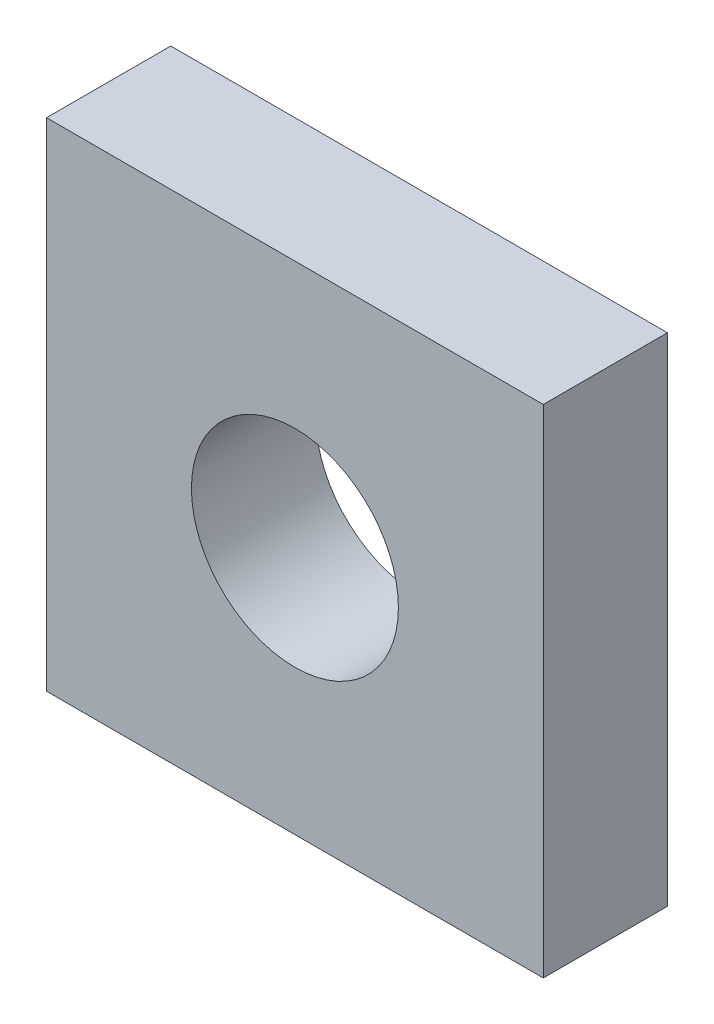
ISO-10303-21;
HEADER;
FILE_DESCRIPTION(('STEP AP214'),'2;1');
FILE_NAME('part.step','',(''),(''),'','','');
FILE_SCHEMA(('AUTOMOTIVE_DESIGN { 1 0 10303 214 1 1 1 1 }'));
ENDSEC;
DATA;
#1=APPLICATION_CONTEXT('core data for automotive mechanical design processes');
#2=APPLICATION_PROTOCOL_DEFINITION('international standard','automotive_design',2000,#1);
#3=PRODUCT_CONTEXT('',#1,'mechanical');
#4=PRODUCT('Part','Part','',(#3));
#5=PRODUCT_RELATED_PRODUCT_CATEGORY('part','',(#4));
#6=PRODUCT_DEFINITION_FORMATION('','',#4);
#7=PRODUCT_DEFINITION_CONTEXT('part definition',#1,'design');
#8=PRODUCT_DEFINITION('design','',#6,#7);
#9=PRODUCT_DEFINITION_SHAPE('','',#8);
#10=(LENGTH_UNIT() NAMED_UNIT(*) SI_UNIT(.MILLI.,.METRE.));
#11=(NAMED_UNIT(*) PLANE_ANGLE_UNIT() SI_UNIT($,.RADIAN.));
#12=(NAMED_UNIT(*) SI_UNIT($,.STERADIAN.) SOLID_ANGLE_UNIT());
#13=UNCERTAINTY_MEASURE_WITH_UNIT(LENGTH_MEASURE(1.E-05),#10,'distance_accuracy_value','');
#14=(GEOMETRIC_REPRESENTATION_CONTEXT(3) GLOBAL_UNCERTAINTY_ASSIGNED_CONTEXT((#13)) GLOBAL_UNIT_ASSIGNED_CONTEXT((#10,
#11,#12)) REPRESENTATION_CONTEXT('',''));
#15=CARTESIAN_POINT('',(0.,0.,0.));
#16=DIRECTION('',(0.,0.,1.));
#17=DIRECTION('',(1.,0.,0.));
#18=AXIS2_PLACEMENT_3D('',#15,#16,#17);
#19=CARTESIAN_POINT('',(30.,-30.0000000000007,7.50000000000006));
#20=DIRECTION('',(0.,0.999999999999999,0.));
#21=DIRECTION('',(0.,0.,0.999999999999999));
#22=AXIS2_PLACEMENT_3D('',#19,#20,#21);
#23=PLANE('',#22);
#24=DIRECTION('',(0.,0.,-0.999999999999999));
#25=VECTOR('',#24,1.);
#26=CARTESIAN_POINT('',(-29.9999999999998,-30.0000000000006,7.49999999999995));
#27=LINE('',#26,#25);
#28=CARTESIAN_POINT('',(-29.9999999999998,-30.0000000000006,7.49999999999995));
#29=VERTEX_POINT('',#28);
#30=CARTESIAN_POINT('',(-29.9999999999999,-30.0000000000009,-7.50000000000006));
#31=VERTEX_POINT('',#30);
#32=EDGE_CURVE('E113',#29,#31,#27,.T.);
#33=ORIENTED_EDGE('',*,*,#32,.T.);
#34=DIRECTION('',(-0.999999999999998,0.,0.));
#35=VECTOR('',#34,1.);
#36=CARTESIAN_POINT('',(29.9999999999999,-30.0000000000008,-7.49999999999995));
#37=LINE('',#36,#35);
#38=CARTESIAN_POINT('',(29.9999999999999,-30.0000000000008,-7.49999999999995));
#39=VERTEX_POINT('',#38);
#40=EDGE_CURVE('E12',#39,#31,#37,.T.);
#41=ORIENTED_EDGE('',*,*,#40,.F.);
#42=DIRECTION('',(0.,0.,-0.999999999999999));
#43=VECTOR('',#42,1.);
#44=CARTESIAN_POINT('',(30.,-30.0000000000007,7.50000000000006));
#45=LINE('',#44,#43);
#46=CARTESIAN_POINT('',(30.,-30.0000000000007,7.50000000000006));
#47=VERTEX_POINT('',#46);
#48=EDGE_CURVE('E101',#47,#39,#45,.T.);
#49=ORIENTED_EDGE('',*,*,#48,.F.);
#50=DIRECTION('',(-0.999999999999998,0.,0.));
#51=VECTOR('',#50,1.);
#52=CARTESIAN_POINT('',(30.,-30.0000000000007,7.50000000000006));
#53=LINE('',#52,#51);
#54=EDGE_CURVE('E109',#47,#29,#53,.T.);
#55=ORIENTED_EDGE('',*,*,#54,.T.);
#56=EDGE_LOOP('',(#33,#41,#49,#55));
#57=FACE_BOUND('',#56,.T.);
#58=ADVANCED_FACE('F50',(#57),#23,.F.);
#59=CARTESIAN_POINT('',(29.9999999999999,-30.0000000000008,-7.49999999999995));
#60=DIRECTION('',(0.,0.,0.999999999999999));
#61=DIRECTION('',(0.999999999999998,0.,0.));
#62=AXIS2_PLACEMENT_3D('',#59,#60,#61);
#63=PLANE('',#62);
#64=CARTESIAN_POINT('',(2.22044604925031E-13,-6.66133814775094E-13,-7.49999999999995));
#65=DIRECTION('',(0.,0.,0.999999999999999));
#66=DIRECTION('',(0.999999999999998,0.,0.));
#67=AXIS2_PLACEMENT_3D('',#64,#65,#66);
#68=CIRCLE('',#67,12.5);
#69=CARTESIAN_POINT('',(12.5000000000002,-6.59888810261578E-13,-7.49999999999995));
#70=VERTEX_POINT('',#69);
#71=EDGE_CURVE('E116',#70,#70,#68,.T.);
#72=ORIENTED_EDGE('',*,*,#71,.T.);
#73=EDGE_LOOP('',(#72));
#74=FACE_BOUND('',#73,.T.);
#75=DIRECTION('',(0.,0.999999999999999,0.));
#76=VECTOR('',#75,1.);
#77=CARTESIAN_POINT('',(-29.9999999999999,-30.0000000000009,-7.50000000000006));
#78=LINE('',#77,#76);
#79=CARTESIAN_POINT('',(-29.9999999999999,29.9999999999989,-7.50000000000006));
#80=VERTEX_POINT('',#79);
#81=EDGE_CURVE('E105',#31,#80,#78,.T.);
#82=ORIENTED_EDGE('',*,*,#81,.T.);
#83=DIRECTION('',(-0.999999999999998,0.,0.));
#84=VECTOR('',#83,1.);
#85=CARTESIAN_POINT('',(29.9999999999995,29.9999999999988,-7.49999999999995));
#86=LINE('',#85,#84);
#87=CARTESIAN_POINT('',(29.9999999999995,29.9999999999988,-7.49999999999995));
#88=VERTEX_POINT('',#87);
#89=EDGE_CURVE('E58',#88,#80,#86,.T.);
#90=ORIENTED_EDGE('',*,*,#89,.F.);
#91=DIRECTION('',(0.,0.999999999999999,0.));
#92=VECTOR('',#91,1.);
#93=CARTESIAN_POINT('',(29.9999999999999,-30.0000000000008,-7.49999999999995));
#94=LINE('',#93,#92);
#95=EDGE_CURVE('E96',#39,#88,#94,.T.);
#96=ORIENTED_EDGE('',*,*,#95,.F.);
#97=ORIENTED_EDGE('',*,*,#40,.T.);
#98=EDGE_LOOP('',(#82,#90,#96,#97));
#99=FACE_BOUND('',#98,.T.);
#100=ADVANCED_FACE('F104',(#74,#99),#63,.F.);
#101=CARTESIAN_POINT('',(29.9999999999999,29.9999999999989,7.50000000000006));
#102=DIRECTION('',(0.,-0.999999999999999,0.));
#103=DIRECTION('',(0.,0.,-0.999999999999999));
#104=AXIS2_PLACEMENT_3D('',#101,#102,#103);
#105=PLANE('',#104);
#106=DIRECTION('',(0.,0.,0.999999999999999));
#107=VECTOR('',#106,1.);
#108=CARTESIAN_POINT('',(-29.9999999999999,29.9999999999993,7.49999999999995));
#109=LINE('',#108,#107);
#110=CARTESIAN_POINT('',(-29.9999999999999,29.9999999999993,7.49999999999995));
#111=VERTEX_POINT('',#110);
#112=EDGE_CURVE('E83',#80,#111,#109,.T.);
#113=ORIENTED_EDGE('',*,*,#112,.T.);
#114=DIRECTION('',(-0.999999999999998,0.,0.));
#115=VECTOR('',#114,1.);
#116=CARTESIAN_POINT('',(29.9999999999999,29.9999999999989,7.50000000000006));
#117=LINE('',#116,#115);
#118=CARTESIAN_POINT('',(29.9999999999999,29.9999999999989,7.50000000000006));
#119=VERTEX_POINT('',#118);
#120=EDGE_CURVE('E106',#119,#111,#117,.T.);
#121=ORIENTED_EDGE('',*,*,#120,.F.);
#122=DIRECTION('',(0.,0.,0.999999999999999));
#123=VECTOR('',#122,1.);
#124=CARTESIAN_POINT('',(29.9999999999999,29.9999999999989,7.50000000000006));
#125=LINE('',#124,#123);
#126=EDGE_CURVE('E99',#88,#119,#125,.T.);
#127=ORIENTED_EDGE('',*,*,#126,.F.);
#128=ORIENTED_EDGE('',*,*,#89,.T.);
#129=EDGE_LOOP('',(#113,#121,#127,#128));
#130=FACE_BOUND('',#129,.T.);
#131=ADVANCED_FACE('F107',(#130),#105,.F.);
#132=CARTESIAN_POINT('',(30.,-30.0000000000007,7.50000000000006));
#133=DIRECTION('',(0.,0.,-0.999999999999999));
#134=DIRECTION('',(-0.999999999999998,0.,0.));
#135=AXIS2_PLACEMENT_3D('',#132,#133,#134);
#136=PLANE('',#135);
#137=CARTESIAN_POINT('',(-2.22044604925031E-13,-7.7715611723761E-13,7.49999999999995));
#138=DIRECTION('',(0.,0.,0.999999999999999));
#139=DIRECTION('',(0.999999999999998,0.,0.));
#140=AXIS2_PLACEMENT_3D('',#137,#138,#139);
#141=CIRCLE('',#140,12.5);
#142=CARTESIAN_POINT('',(12.4999999999998,-7.70911112724094E-13,7.49999999999995));
#143=VERTEX_POINT('',#142);
#144=EDGE_CURVE('E129',#143,#143,#141,.T.);
#145=ORIENTED_EDGE('',*,*,#144,.F.);
#146=EDGE_LOOP('',(#145));
#147=FACE_BOUND('',#146,.T.);
#148=DIRECTION('',(0.,-0.999999999999999,0.));
#149=VECTOR('',#148,1.);
#150=CARTESIAN_POINT('',(-29.9999999999998,-30.0000000000006,7.49999999999995));
#151=LINE('',#150,#149);
#152=EDGE_CURVE('E89',#111,#29,#151,.T.);
#153=ORIENTED_EDGE('',*,*,#152,.T.);
#154=ORIENTED_EDGE('',*,*,#54,.F.);
#155=DIRECTION('',(0.,-0.999999999999999,0.));
#156=VECTOR('',#155,1.);
#157=CARTESIAN_POINT('',(30.,-30.0000000000007,7.50000000000006));
#158=LINE('',#157,#156);
#159=EDGE_CURVE('E66',#119,#47,#158,.T.);
#160=ORIENTED_EDGE('',*,*,#159,.F.);
#161=ORIENTED_EDGE('',*,*,#120,.T.);
#162=EDGE_LOOP('',(#153,#154,#160,#161));
#163=FACE_BOUND('',#162,.T.);
#164=ADVANCED_FACE('F121',(#147,#163),#136,.F.);
#165=CARTESIAN_POINT('',(29.9999999999999,-30.0000000000008,-7.49999999999995));
#166=DIRECTION('',(0.999999999999998,0.,0.));
#167=DIRECTION('',(0.,0.,-0.999999999999999));
#168=AXIS2_PLACEMENT_3D('',#165,#166,#167);
#169=PLANE('',#168);
#170=ORIENTED_EDGE('',*,*,#48,.T.);
#171=ORIENTED_EDGE('',*,*,#95,.T.);
#172=ORIENTED_EDGE('',*,*,#126,.T.);
#173=ORIENTED_EDGE('',*,*,#159,.T.);
#174=EDGE_LOOP('',(#170,#171,#172,#173));
#175=FACE_BOUND('',#174,.T.);
#176=ADVANCED_FACE('F97',(#175),#169,.T.);
#177=CARTESIAN_POINT('',(-29.9999999999999,-30.0000000000009,-7.50000000000006));
#178=DIRECTION('',(0.999999999999998,0.,0.));
#179=DIRECTION('',(0.,0.,-0.999999999999999));
#180=AXIS2_PLACEMENT_3D('',#177,#178,#179);
#181=PLANE('',#180);
#182=ORIENTED_EDGE('',*,*,#32,.F.);
#183=ORIENTED_EDGE('',*,*,#152,.F.);
#184=ORIENTED_EDGE('',*,*,#112,.F.);
#185=ORIENTED_EDGE('',*,*,#81,.F.);
#186=EDGE_LOOP('',(#182,#183,#184,#185));
#187=FACE_BOUND('',#186,.T.);
#188=ADVANCED_FACE('F124',(#187),#181,.F.);
#189=CARTESIAN_POINT('',(-1.11022302462516E-13,-7.7715611723761E-13,-12.5));
#190=DIRECTION('',(0.,0.,0.999999999999999));
#191=DIRECTION('',(0.999999999999998,0.,0.));
#192=AXIS2_PLACEMENT_3D('',#189,#190,#191);
#193=CYLINDRICAL_SURFACE('',#192,12.5);
#194=ORIENTED_EDGE('',*,*,#144,.T.);
#195=EDGE_LOOP('',(#194));
#196=FACE_BOUND('',#195,.T.);
#197=ORIENTED_EDGE('',*,*,#71,.F.);
#198=EDGE_LOOP('',(#197));
#199=FACE_BOUND('',#198,.T.);
#200=ADVANCED_FACE('F133',(#196,#199),#193,.F.);
#201=CLOSED_SHELL('',(#58,#100,#131,#164,#176,#188,#200));
#202=MANIFOLD_SOLID_BREP('B2',#201);
#203=ADVANCED_BREP_SHAPE_REPRESENTATION('',(#18,#202),#14);
#204=SHAPE_DEFINITION_REPRESENTATION(#9,#203);
ENDSEC;
END-ISO-10303-21;
